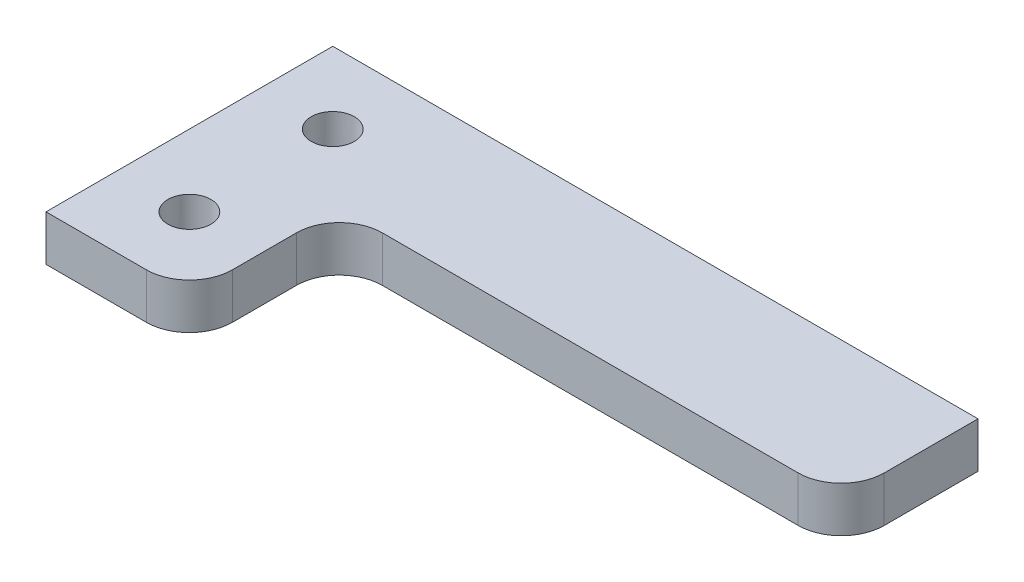
ISO-10303-21;
HEADER;
FILE_DESCRIPTION(('STEP AP214'),'2;1');
FILE_NAME('part.step','',(''),(''),'','','');
FILE_SCHEMA(('AUTOMOTIVE_DESIGN { 1 0 10303 214 1 1 1 1 }'));
ENDSEC;
DATA;
#1=APPLICATION_CONTEXT('core data for automotive mechanical design processes');
#2=APPLICATION_PROTOCOL_DEFINITION('international standard','automotive_design',2000,#1);
#3=PRODUCT_CONTEXT('',#1,'mechanical');
#4=PRODUCT('Part','Part','',(#3));
#5=PRODUCT_RELATED_PRODUCT_CATEGORY('part','',(#4));
#6=PRODUCT_DEFINITION_FORMATION('','',#4);
#7=PRODUCT_DEFINITION_CONTEXT('part definition',#1,'design');
#8=PRODUCT_DEFINITION('design','',#6,#7);
#9=PRODUCT_DEFINITION_SHAPE('','',#8);
#10=(LENGTH_UNIT() NAMED_UNIT(*) SI_UNIT(.MILLI.,.METRE.));
#11=(NAMED_UNIT(*) PLANE_ANGLE_UNIT() SI_UNIT($,.RADIAN.));
#12=(NAMED_UNIT(*) SI_UNIT($,.STERADIAN.) SOLID_ANGLE_UNIT());
#13=UNCERTAINTY_MEASURE_WITH_UNIT(LENGTH_MEASURE(1.E-05),#10,'distance_accuracy_value','');
#14=(GEOMETRIC_REPRESENTATION_CONTEXT(3) GLOBAL_UNCERTAINTY_ASSIGNED_CONTEXT((#13)) GLOBAL_UNIT_ASSIGNED_CONTEXT((#10,
#11,#12)) REPRESENTATION_CONTEXT('',''));
#15=CARTESIAN_POINT('',(0.,0.,0.));
#16=DIRECTION('',(0.,0.,1.));
#17=DIRECTION('',(1.,0.,0.));
#18=AXIS2_PLACEMENT_3D('',#15,#16,#17);
#19=CARTESIAN_POINT('',(0.,3.175,20.));
#20=DIRECTION('',(1.,0.,0.));
#21=DIRECTION('',(0.,0.,-1.));
#22=AXIS2_PLACEMENT_3D('',#19,#20,#21);
#23=PLANE('',#22);
#24=DIRECTION('',(0.,0.,1.));
#25=VECTOR('',#24,1.);
#26=CARTESIAN_POINT('',(0.,0.,20.));
#27=LINE('',#26,#25);
#28=CARTESIAN_POINT('',(0.,0.,0.));
#29=VERTEX_POINT('',#28);
#30=CARTESIAN_POINT('',(0.,0.,20.));
#31=VERTEX_POINT('',#30);
#32=EDGE_CURVE('E134',#29,#31,#27,.T.);
#33=ORIENTED_EDGE('',*,*,#32,.T.);
#34=DIRECTION('',(0.,-1.,0.));
#35=VECTOR('',#34,1.);
#36=CARTESIAN_POINT('',(0.,3.175,20.));
#37=LINE('',#36,#35);
#38=CARTESIAN_POINT('',(0.,3.175,20.));
#39=VERTEX_POINT('',#38);
#40=EDGE_CURVE('E11',#39,#31,#37,.T.);
#41=ORIENTED_EDGE('',*,*,#40,.F.);
#42=DIRECTION('',(0.,0.,1.));
#43=VECTOR('',#42,1.);
#44=CARTESIAN_POINT('',(0.,3.175,20.));
#45=LINE('',#44,#43);
#46=CARTESIAN_POINT('',(0.,3.175,0.));
#47=VERTEX_POINT('',#46);
#48=EDGE_CURVE('E151',#47,#39,#45,.T.);
#49=ORIENTED_EDGE('',*,*,#48,.F.);
#50=DIRECTION('',(0.,-1.,0.));
#51=VECTOR('',#50,1.);
#52=CARTESIAN_POINT('',(0.,3.175,0.));
#53=LINE('',#52,#51);
#54=EDGE_CURVE('E130',#47,#29,#53,.T.);
#55=ORIENTED_EDGE('',*,*,#54,.T.);
#56=EDGE_LOOP('',(#33,#41,#49,#55));
#57=FACE_BOUND('',#56,.T.);
#58=ADVANCED_FACE('F32',(#57),#23,.F.);
#59=CARTESIAN_POINT('',(0.,3.175,20.));
#60=DIRECTION('',(0.,0.,-1.));
#61=DIRECTION('',(-1.,0.,0.));
#62=AXIS2_PLACEMENT_3D('',#59,#60,#61);
#63=PLANE('',#62);
#64=DIRECTION('',(1.,0.,0.));
#65=VECTOR('',#64,1.);
#66=CARTESIAN_POINT('',(0.,0.,20.));
#67=LINE('',#66,#65);
#68=CARTESIAN_POINT('',(7.,0.,20.));
#69=VERTEX_POINT('',#68);
#70=EDGE_CURVE('E137',#31,#69,#67,.T.);
#71=ORIENTED_EDGE('',*,*,#70,.T.);
#72=DIRECTION('',(0.,-1.,0.));
#73=VECTOR('',#72,1.);
#74=CARTESIAN_POINT('',(7.,3.175,20.));
#75=LINE('',#74,#73);
#76=CARTESIAN_POINT('',(7.,3.175,20.));
#77=VERTEX_POINT('',#76);
#78=EDGE_CURVE('E40',#77,#69,#75,.T.);
#79=ORIENTED_EDGE('',*,*,#78,.F.);
#80=DIRECTION('',(1.,0.,0.));
#81=VECTOR('',#80,1.);
#82=CARTESIAN_POINT('',(0.,3.175,20.));
#83=LINE('',#82,#81);
#84=EDGE_CURVE('E94',#39,#77,#83,.T.);
#85=ORIENTED_EDGE('',*,*,#84,.F.);
#86=ORIENTED_EDGE('',*,*,#40,.T.);
#87=EDGE_LOOP('',(#71,#79,#85,#86));
#88=FACE_BOUND('',#87,.T.);
#89=ADVANCED_FACE('F225',(#88),#63,.F.);
#90=CARTESIAN_POINT('',(7.,3.175,17.));
#91=DIRECTION('',(0.,-1.,0.));
#92=DIRECTION('',(0.,0.,-1.));
#93=AXIS2_PLACEMENT_3D('',#90,#91,#92);
#94=CYLINDRICAL_SURFACE('',#93,3.);
#95=CARTESIAN_POINT('',(7.,0.,17.));
#96=DIRECTION('',(0.,1.,0.));
#97=DIRECTION('',(0.,0.,-1.));
#98=AXIS2_PLACEMENT_3D('',#95,#96,#97);
#99=CIRCLE('',#98,3.);
#100=CARTESIAN_POINT('',(9.99999999999999,0.,17.));
#101=VERTEX_POINT('',#100);
#102=EDGE_CURVE('E140',#69,#101,#99,.T.);
#103=ORIENTED_EDGE('',*,*,#102,.T.);
#104=DIRECTION('',(0.,-1.,0.));
#105=VECTOR('',#104,1.);
#106=CARTESIAN_POINT('',(9.99999999999999,3.175,17.));
#107=LINE('',#106,#105);
#108=CARTESIAN_POINT('',(9.99999999999999,3.175,17.));
#109=VERTEX_POINT('',#108);
#110=EDGE_CURVE('E161',#109,#101,#107,.T.);
#111=ORIENTED_EDGE('',*,*,#110,.F.);
#112=CARTESIAN_POINT('',(7.,3.175,17.));
#113=DIRECTION('',(0.,1.,0.));
#114=DIRECTION('',(0.,0.,-1.));
#115=AXIS2_PLACEMENT_3D('',#112,#113,#114);
#116=CIRCLE('',#115,3.);
#117=EDGE_CURVE('E169',#77,#109,#116,.T.);
#118=ORIENTED_EDGE('',*,*,#117,.F.);
#119=ORIENTED_EDGE('',*,*,#78,.T.);
#120=EDGE_LOOP('',(#103,#111,#118,#119));
#121=FACE_BOUND('',#120,.T.);
#122=ADVANCED_FACE('F167',(#121),#94,.T.);
#123=CARTESIAN_POINT('',(9.99999999999999,3.175,17.));
#124=DIRECTION('',(-1.,0.,0.));
#125=DIRECTION('',(0.,0.,1.));
#126=AXIS2_PLACEMENT_3D('',#123,#124,#125);
#127=PLANE('',#126);
#128=DIRECTION('',(0.,0.,-1.));
#129=VECTOR('',#128,1.);
#130=CARTESIAN_POINT('',(9.99999999999999,0.,17.));
#131=LINE('',#130,#129);
#132=CARTESIAN_POINT('',(10.,0.,12.5393920141695));
#133=VERTEX_POINT('',#132);
#134=EDGE_CURVE('E142',#101,#133,#131,.T.);
#135=ORIENTED_EDGE('',*,*,#134,.T.);
#136=DIRECTION('',(0.,-1.,0.));
#137=VECTOR('',#136,1.);
#138=CARTESIAN_POINT('',(10.,3.175,12.5393920141695));
#139=LINE('',#138,#137);
#140=CARTESIAN_POINT('',(10.,3.175,12.5393920141695));
#141=VERTEX_POINT('',#140);
#142=EDGE_CURVE('E158',#141,#133,#139,.T.);
#143=ORIENTED_EDGE('',*,*,#142,.F.);
#144=DIRECTION('',(0.,0.,-1.));
#145=VECTOR('',#144,1.);
#146=CARTESIAN_POINT('',(9.99999999999999,3.175,17.));
#147=LINE('',#146,#145);
#148=EDGE_CURVE('E185',#109,#141,#147,.T.);
#149=ORIENTED_EDGE('',*,*,#148,.F.);
#150=ORIENTED_EDGE('',*,*,#110,.T.);
#151=EDGE_LOOP('',(#135,#143,#149,#150));
#152=FACE_BOUND('',#151,.T.);
#153=ADVANCED_FACE('F178',(#152),#127,.F.);
#154=CARTESIAN_POINT('',(13.,3.175,12.5393920141695));
#155=DIRECTION('',(0.,-1.,0.));
#156=DIRECTION('',(0.,0.,-1.));
#157=AXIS2_PLACEMENT_3D('',#154,#155,#156);
#158=CYLINDRICAL_SURFACE('',#157,3.);
#159=CARTESIAN_POINT('',(13.,0.,12.5393920141695));
#160=DIRECTION('',(0.,-1.,0.));
#161=DIRECTION('',(0.,0.,-1.));
#162=AXIS2_PLACEMENT_3D('',#159,#160,#161);
#163=CIRCLE('',#162,3.);
#164=CARTESIAN_POINT('',(13.,0.,9.53939201416946));
#165=VERTEX_POINT('',#164);
#166=EDGE_CURVE('E144',#133,#165,#163,.T.);
#167=ORIENTED_EDGE('',*,*,#166,.T.);
#168=DIRECTION('',(0.,-1.,0.));
#169=VECTOR('',#168,1.);
#170=CARTESIAN_POINT('',(13.,3.175,9.53939201416946));
#171=LINE('',#170,#169);
#172=CARTESIAN_POINT('',(13.,3.175,9.53939201416946));
#173=VERTEX_POINT('',#172);
#174=EDGE_CURVE('E155',#173,#165,#171,.T.);
#175=ORIENTED_EDGE('',*,*,#174,.F.);
#176=CARTESIAN_POINT('',(13.,3.175,12.5393920141695));
#177=DIRECTION('',(0.,-1.,0.));
#178=DIRECTION('',(0.,0.,-1.));
#179=AXIS2_PLACEMENT_3D('',#176,#177,#178);
#180=CIRCLE('',#179,3.);
#181=EDGE_CURVE('E184',#141,#173,#180,.T.);
#182=ORIENTED_EDGE('',*,*,#181,.F.);
#183=ORIENTED_EDGE('',*,*,#142,.T.);
#184=EDGE_LOOP('',(#167,#175,#182,#183));
#185=FACE_BOUND('',#184,.T.);
#186=ADVANCED_FACE('F182',(#185),#158,.F.);
#187=CARTESIAN_POINT('',(42.,3.175,9.53939201416945));
#188=DIRECTION('',(0.,0.,-1.));
#189=DIRECTION('',(-1.,0.,0.));
#190=AXIS2_PLACEMENT_3D('',#187,#188,#189);
#191=PLANE('',#190);
#192=DIRECTION('',(1.,0.,0.));
#193=VECTOR('',#192,1.);
#194=CARTESIAN_POINT('',(42.,0.,9.53939201416945));
#195=LINE('',#194,#193);
#196=CARTESIAN_POINT('',(42.,0.,9.53939201416945));
#197=VERTEX_POINT('',#196);
#198=EDGE_CURVE('E146',#165,#197,#195,.T.);
#199=ORIENTED_EDGE('',*,*,#198,.T.);
#200=DIRECTION('',(0.,-1.,0.));
#201=VECTOR('',#200,1.);
#202=CARTESIAN_POINT('',(42.,3.175,9.53939201416945));
#203=LINE('',#202,#201);
#204=CARTESIAN_POINT('',(42.,3.175,9.53939201416945));
#205=VERTEX_POINT('',#204);
#206=EDGE_CURVE('E125',#205,#197,#203,.T.);
#207=ORIENTED_EDGE('',*,*,#206,.F.);
#208=DIRECTION('',(1.,0.,0.));
#209=VECTOR('',#208,1.);
#210=CARTESIAN_POINT('',(42.,3.175,9.53939201416945));
#211=LINE('',#210,#209);
#212=EDGE_CURVE('E116',#173,#205,#211,.T.);
#213=ORIENTED_EDGE('',*,*,#212,.F.);
#214=ORIENTED_EDGE('',*,*,#174,.T.);
#215=EDGE_LOOP('',(#199,#207,#213,#214));
#216=FACE_BOUND('',#215,.T.);
#217=ADVANCED_FACE('F233',(#216),#191,.F.);
#218=CARTESIAN_POINT('',(42.,3.175,6.53939201416945));
#219=DIRECTION('',(0.,-1.,0.));
#220=DIRECTION('',(0.,0.,-1.));
#221=AXIS2_PLACEMENT_3D('',#218,#219,#220);
#222=CYLINDRICAL_SURFACE('',#221,3.);
#223=CARTESIAN_POINT('',(42.,0.,6.53939201416945));
#224=DIRECTION('',(0.,1.,0.));
#225=DIRECTION('',(0.,0.,-1.));
#226=AXIS2_PLACEMENT_3D('',#223,#224,#225);
#227=CIRCLE('',#226,3.);
#228=CARTESIAN_POINT('',(45.,0.,6.53939201416945));
#229=VERTEX_POINT('',#228);
#230=EDGE_CURVE('E124',#197,#229,#227,.T.);
#231=ORIENTED_EDGE('',*,*,#230,.T.);
#232=DIRECTION('',(0.,-1.,0.));
#233=VECTOR('',#232,1.);
#234=CARTESIAN_POINT('',(45.,3.175,6.53939201416945));
#235=LINE('',#234,#233);
#236=CARTESIAN_POINT('',(45.,3.175,6.53939201416945));
#237=VERTEX_POINT('',#236);
#238=EDGE_CURVE('E121',#237,#229,#235,.T.);
#239=ORIENTED_EDGE('',*,*,#238,.F.);
#240=CARTESIAN_POINT('',(42.,3.175,6.53939201416945));
#241=DIRECTION('',(0.,1.,0.));
#242=DIRECTION('',(0.,0.,-1.));
#243=AXIS2_PLACEMENT_3D('',#240,#241,#242);
#244=CIRCLE('',#243,3.);
#245=EDGE_CURVE('E110',#205,#237,#244,.T.);
#246=ORIENTED_EDGE('',*,*,#245,.F.);
#247=ORIENTED_EDGE('',*,*,#206,.T.);
#248=EDGE_LOOP('',(#231,#239,#246,#247));
#249=FACE_BOUND('',#248,.T.);
#250=ADVANCED_FACE('F122',(#249),#222,.T.);
#251=CARTESIAN_POINT('',(45.,3.175,0.));
#252=DIRECTION('',(-1.,0.,0.));
#253=DIRECTION('',(0.,0.,1.));
#254=AXIS2_PLACEMENT_3D('',#251,#252,#253);
#255=PLANE('',#254);
#256=DIRECTION('',(0.,0.,-1.));
#257=VECTOR('',#256,1.);
#258=CARTESIAN_POINT('',(45.,0.,0.));
#259=LINE('',#258,#257);
#260=CARTESIAN_POINT('',(45.,0.,0.));
#261=VERTEX_POINT('',#260);
#262=EDGE_CURVE('E80',#229,#261,#259,.T.);
#263=ORIENTED_EDGE('',*,*,#262,.T.);
#264=DIRECTION('',(0.,-1.,0.));
#265=VECTOR('',#264,1.);
#266=CARTESIAN_POINT('',(45.,3.175,0.));
#267=LINE('',#266,#265);
#268=CARTESIAN_POINT('',(45.,3.175,0.));
#269=VERTEX_POINT('',#268);
#270=EDGE_CURVE('E126',#269,#261,#267,.T.);
#271=ORIENTED_EDGE('',*,*,#270,.F.);
#272=DIRECTION('',(0.,0.,-1.));
#273=VECTOR('',#272,1.);
#274=CARTESIAN_POINT('',(45.,3.175,0.));
#275=LINE('',#274,#273);
#276=EDGE_CURVE('E114',#237,#269,#275,.T.);
#277=ORIENTED_EDGE('',*,*,#276,.F.);
#278=ORIENTED_EDGE('',*,*,#238,.T.);
#279=EDGE_LOOP('',(#263,#271,#277,#278));
#280=FACE_BOUND('',#279,.T.);
#281=ADVANCED_FACE('F128',(#280),#255,.F.);
#282=CARTESIAN_POINT('',(0.,3.175,0.));
#283=DIRECTION('',(0.,0.,1.));
#284=DIRECTION('',(1.,0.,0.));
#285=AXIS2_PLACEMENT_3D('',#282,#283,#284);
#286=PLANE('',#285);
#287=DIRECTION('',(-1.,0.,0.));
#288=VECTOR('',#287,1.);
#289=CARTESIAN_POINT('',(0.,0.,0.));
#290=LINE('',#289,#288);
#291=EDGE_CURVE('E86',#261,#29,#290,.T.);
#292=ORIENTED_EDGE('',*,*,#291,.T.);
#293=ORIENTED_EDGE('',*,*,#54,.F.);
#294=DIRECTION('',(-1.,0.,0.));
#295=VECTOR('',#294,1.);
#296=CARTESIAN_POINT('',(0.,3.175,0.));
#297=LINE('',#296,#295);
#298=EDGE_CURVE('E48',#269,#47,#297,.T.);
#299=ORIENTED_EDGE('',*,*,#298,.F.);
#300=ORIENTED_EDGE('',*,*,#270,.T.);
#301=EDGE_LOOP('',(#292,#293,#299,#300));
#302=FACE_BOUND('',#301,.T.);
#303=ADVANCED_FACE('F208',(#302),#286,.F.);
#304=CARTESIAN_POINT('',(42.,3.175,6.53939201416945));
#305=DIRECTION('',(0.,-1.,0.));
#306=DIRECTION('',(0.,0.,-1.));
#307=AXIS2_PLACEMENT_3D('',#304,#305,#306);
#308=PLANE('',#307);
#309=CARTESIAN_POINT('',(5.,3.175,5.));
#310=DIRECTION('',(0.,1.,0.));
#311=DIRECTION('',(0.,0.,1.));
#312=AXIS2_PLACEMENT_3D('',#309,#310,#311);
#313=CIRCLE('',#312,1.49999999999999);
#314=CARTESIAN_POINT('',(5.,3.175,6.49999999999999));
#315=VERTEX_POINT('',#314);
#316=EDGE_CURVE('E200',#315,#315,#313,.T.);
#317=ORIENTED_EDGE('',*,*,#316,.F.);
#318=EDGE_LOOP('',(#317));
#319=FACE_BOUND('',#318,.T.);
#320=CARTESIAN_POINT('',(5.,3.175,15.));
#321=DIRECTION('',(0.,1.,0.));
#322=DIRECTION('',(0.,0.,1.));
#323=AXIS2_PLACEMENT_3D('',#320,#321,#322);
#324=CIRCLE('',#323,1.49999999999999);
#325=CARTESIAN_POINT('',(5.,3.175,16.5));
#326=VERTEX_POINT('',#325);
#327=EDGE_CURVE('E194',#326,#326,#324,.T.);
#328=ORIENTED_EDGE('',*,*,#327,.F.);
#329=EDGE_LOOP('',(#328));
#330=FACE_BOUND('',#329,.T.);
#331=ORIENTED_EDGE('',*,*,#48,.T.);
#332=ORIENTED_EDGE('',*,*,#84,.T.);
#333=ORIENTED_EDGE('',*,*,#117,.T.);
#334=ORIENTED_EDGE('',*,*,#148,.T.);
#335=ORIENTED_EDGE('',*,*,#181,.T.);
#336=ORIENTED_EDGE('',*,*,#212,.T.);
#337=ORIENTED_EDGE('',*,*,#245,.T.);
#338=ORIENTED_EDGE('',*,*,#276,.T.);
#339=ORIENTED_EDGE('',*,*,#298,.T.);
#340=EDGE_LOOP('',(#331,#332,#333,#334,#335,#336,#337,#338,#339));
#341=FACE_BOUND('',#340,.T.);
#342=ADVANCED_FACE('F112',(#319,#330,#341),#308,.F.);
#343=CARTESIAN_POINT('',(42.,0.,6.53939201416945));
#344=DIRECTION('',(0.,-1.,0.));
#345=DIRECTION('',(0.,0.,-1.));
#346=AXIS2_PLACEMENT_3D('',#343,#344,#345);
#347=PLANE('',#346);
#348=CARTESIAN_POINT('',(5.,0.,5.));
#349=DIRECTION('',(0.,-1.,0.));
#350=DIRECTION('',(0.,0.,-1.));
#351=AXIS2_PLACEMENT_3D('',#348,#349,#350);
#352=CIRCLE('',#351,1.49999999999999);
#353=CARTESIAN_POINT('',(5.,0.,3.50000000000001));
#354=VERTEX_POINT('',#353);
#355=EDGE_CURVE('E197',#354,#354,#352,.T.);
#356=ORIENTED_EDGE('',*,*,#355,.F.);
#357=EDGE_LOOP('',(#356));
#358=FACE_BOUND('',#357,.T.);
#359=CARTESIAN_POINT('',(5.,0.,15.));
#360=DIRECTION('',(0.,-1.,0.));
#361=DIRECTION('',(0.,0.,-1.));
#362=AXIS2_PLACEMENT_3D('',#359,#360,#361);
#363=CIRCLE('',#362,1.49999999999999);
#364=CARTESIAN_POINT('',(5.,0.,13.5));
#365=VERTEX_POINT('',#364);
#366=EDGE_CURVE('E138',#365,#365,#363,.T.);
#367=ORIENTED_EDGE('',*,*,#366,.F.);
#368=EDGE_LOOP('',(#367));
#369=FACE_BOUND('',#368,.T.);
#370=ORIENTED_EDGE('',*,*,#32,.F.);
#371=ORIENTED_EDGE('',*,*,#291,.F.);
#372=ORIENTED_EDGE('',*,*,#262,.F.);
#373=ORIENTED_EDGE('',*,*,#230,.F.);
#374=ORIENTED_EDGE('',*,*,#198,.F.);
#375=ORIENTED_EDGE('',*,*,#166,.F.);
#376=ORIENTED_EDGE('',*,*,#134,.F.);
#377=ORIENTED_EDGE('',*,*,#102,.F.);
#378=ORIENTED_EDGE('',*,*,#70,.F.);
#379=EDGE_LOOP('',(#370,#371,#372,#373,#374,#375,#376,#377,#378));
#380=FACE_BOUND('',#379,.T.);
#381=ADVANCED_FACE('F173',(#358,#369,#380),#347,.T.);
#382=CARTESIAN_POINT('',(5.,3.175,15.));
#383=DIRECTION('',(0.,1.,0.));
#384=DIRECTION('',(0.,0.,1.));
#385=AXIS2_PLACEMENT_3D('',#382,#383,#384);
#386=CYLINDRICAL_SURFACE('',#385,1.49999999999999);
#387=ORIENTED_EDGE('',*,*,#366,.T.);
#388=EDGE_LOOP('',(#387));
#389=FACE_BOUND('',#388,.T.);
#390=ORIENTED_EDGE('',*,*,#327,.T.);
#391=EDGE_LOOP('',(#390));
#392=FACE_BOUND('',#391,.T.);
#393=ADVANCED_FACE('F212',(#389,#392),#386,.F.);
#394=CARTESIAN_POINT('',(5.,3.175,5.));
#395=DIRECTION('',(0.,1.,0.));
#396=DIRECTION('',(0.,0.,1.));
#397=AXIS2_PLACEMENT_3D('',#394,#395,#396);
#398=CYLINDRICAL_SURFACE('',#397,1.49999999999999);
#399=ORIENTED_EDGE('',*,*,#355,.T.);
#400=EDGE_LOOP('',(#399));
#401=FACE_BOUND('',#400,.T.);
#402=ORIENTED_EDGE('',*,*,#316,.T.);
#403=EDGE_LOOP('',(#402));
#404=FACE_BOUND('',#403,.T.);
#405=ADVANCED_FACE('F204',(#401,#404),#398,.F.);
#406=CLOSED_SHELL('',(#58,#89,#122,#153,#186,#217,#250,#281,#303,#342,#381,#393,#405));
#407=MANIFOLD_SOLID_BREP('B2',#406);
#408=ADVANCED_BREP_SHAPE_REPRESENTATION('',(#18,#407),#14);
#409=SHAPE_DEFINITION_REPRESENTATION(#9,#408);
ENDSEC;
END-ISO-10303-21;
